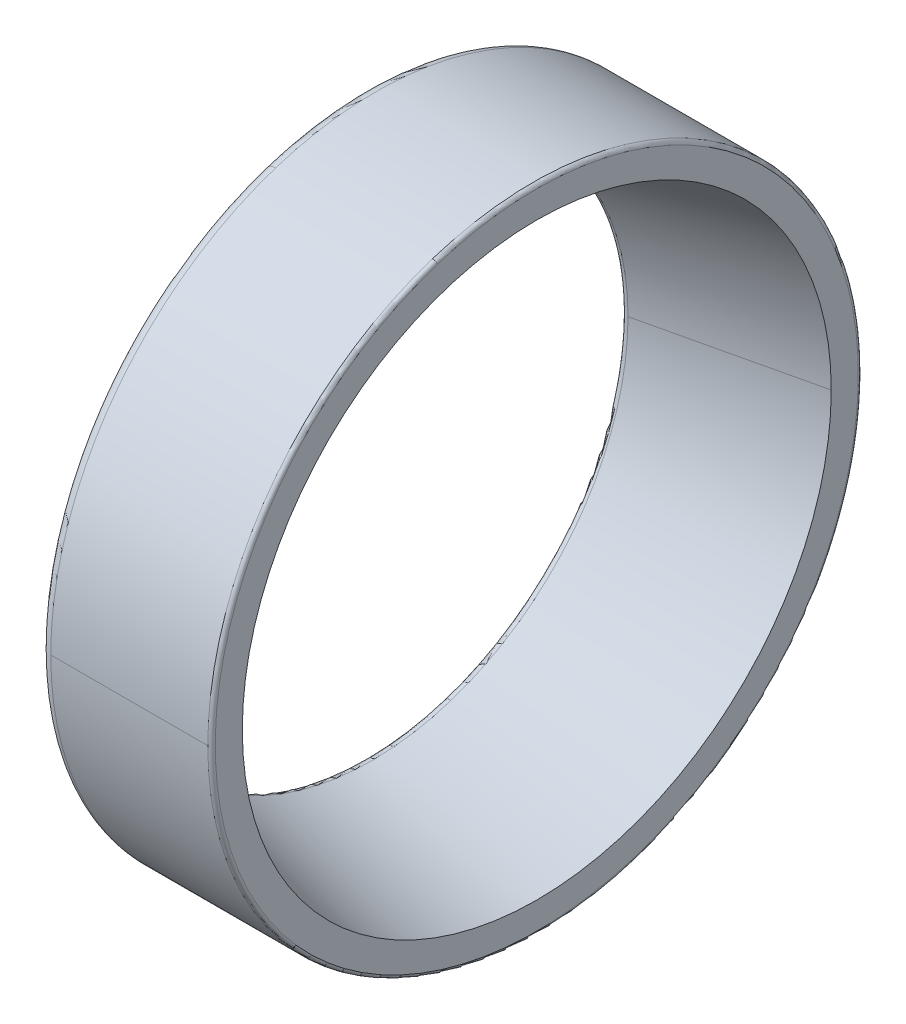
ISO-10303-21;
HEADER;
FILE_DESCRIPTION(('STEP AP214'),'2;1');
FILE_NAME('part.step','',(''),(''),'','','');
FILE_SCHEMA(('AUTOMOTIVE_DESIGN { 1 0 10303 214 1 1 1 1 }'));
ENDSEC;
DATA;
#1=APPLICATION_CONTEXT('core data for automotive mechanical design processes');
#2=APPLICATION_PROTOCOL_DEFINITION('international standard','automotive_design',2000,#1);
#3=PRODUCT_CONTEXT('',#1,'mechanical');
#4=PRODUCT('Part','Part','',(#3));
#5=PRODUCT_RELATED_PRODUCT_CATEGORY('part','',(#4));
#6=PRODUCT_DEFINITION_FORMATION('','',#4);
#7=PRODUCT_DEFINITION_CONTEXT('part definition',#1,'design');
#8=PRODUCT_DEFINITION('design','',#6,#7);
#9=PRODUCT_DEFINITION_SHAPE('','',#8);
#10=(LENGTH_UNIT() NAMED_UNIT(*) SI_UNIT(.MILLI.,.METRE.));
#11=(NAMED_UNIT(*) PLANE_ANGLE_UNIT() SI_UNIT($,.RADIAN.));
#12=(NAMED_UNIT(*) SI_UNIT($,.STERADIAN.) SOLID_ANGLE_UNIT());
#13=UNCERTAINTY_MEASURE_WITH_UNIT(LENGTH_MEASURE(1.E-05),#10,'distance_accuracy_value','');
#14=(GEOMETRIC_REPRESENTATION_CONTEXT(3) GLOBAL_UNCERTAINTY_ASSIGNED_CONTEXT((#13)) GLOBAL_UNIT_ASSIGNED_CONTEXT((#10,
#11,#12)) REPRESENTATION_CONTEXT('',''));
#15=CARTESIAN_POINT('',(0.,0.,0.));
#16=DIRECTION('',(0.,0.,1.));
#17=DIRECTION('',(1.,0.,0.));
#18=AXIS2_PLACEMENT_3D('',#15,#16,#17);
#19=CARTESIAN_POINT('',(0.,16.9,0.));
#20=DIRECTION('',(-1.,0.,0.));
#21=DIRECTION('',(0.,0.,1.));
#22=AXIS2_PLACEMENT_3D('',#19,#20,#21);
#23=PLANE('',#22);
#24=CARTESIAN_POINT('',(0.,0.,0.));
#25=DIRECTION('',(1.,0.,0.));
#26=DIRECTION('',(0.,0.,-1.));
#27=AXIS2_PLACEMENT_3D('',#24,#25,#26);
#28=CIRCLE('',#27,14.085804836206);
#29=CARTESIAN_POINT('',(0.,13.3963964767347,4.35275307383623));
#30=VERTEX_POINT('',#29);
#31=CARTESIAN_POINT('',(0.,-13.3963964767347,-4.35275307383623));
#32=VERTEX_POINT('',#31);
#33=EDGE_CURVE('E11',#30,#32,#28,.T.);
#34=ORIENTED_EDGE('',*,*,#33,.T.);
#35=CARTESIAN_POINT('',(0.,-13.3963964767355,-4.35275307383648));
#36=CARTESIAN_POINT('',(0.,-12.7126398523232,-6.45703442228354));
#37=CARTESIAN_POINT('',(0.,-11.6158787276221,-8.42718808582188));
#38=CARTESIAN_POINT('',(0.,-10.1405103292947,-10.1545294403803));
#39=CARTESIAN_POINT('',(0.,-6.59201516948742,-12.9375532881365));
#40=CARTESIAN_POINT('',(0.,-2.25474563902204,-14.1725400133612));
#41=CARTESIAN_POINT('',(0.,0.00991354990894505,-14.3507764187406));
#42=CARTESIAN_POINT('',(0.,4.48697211895278,-13.8094802222654));
#43=CARTESIAN_POINT('',(0.,8.4271545075314,-11.6158490436707));
#44=CARTESIAN_POINT('',(0.,10.1545375473403,-10.1405194899802));
#45=CARTESIAN_POINT('',(0.,12.9375553228074,-6.59201117622091));
#46=CARTESIAN_POINT('',(0.,14.1725278370594,-2.2547444648695));
#47=CARTESIAN_POINT('',(0.,14.3508201703857,0.00990383229015812));
#48=CARTESIAN_POINT('',(0.,14.0800912908607,2.24845164200969));
#49=CARTESIAN_POINT('',(0.,13.3963964767355,4.35275307383647));
#50=B_SPLINE_CURVE_WITH_KNOTS('',5,(#35,#36,#37,#38,#39,#40,#41,#42,#43,#44,#45,#46,#47,#48,
#49),.UNSPECIFIED.,.F.,.F.,(6,3,3,3,6),(0.,0.785398163397448,1.5707963267949,2.35619449019234,
3.14159265358979),.UNSPECIFIED.);
#51=EDGE_CURVE('E26',#32,#30,#50,.T.);
#52=ORIENTED_EDGE('',*,*,#51,.T.);
#53=EDGE_LOOP('',(#34,#52));
#54=FACE_BOUND('',#53,.T.);
#55=CARTESIAN_POINT('',(0.,16.0728551253881,5.22238720493665));
#56=CARTESIAN_POINT('',(0.,15.987409506985,5.48538076014823));
#57=CARTESIAN_POINT('',(0.,15.8954983020356,5.74627299413518));
#58=CARTESIAN_POINT('',(0.,15.6989902437607,6.26323546914296));
#59=CARTESIAN_POINT('',(0.,15.5943933904351,6.51930571016379));
#60=CARTESIAN_POINT('',(0.,15.3727595601241,7.02600484872245));
#61=CARTESIAN_POINT('',(0.,15.2557225831386,7.27663374626028));
#62=CARTESIAN_POINT('',(0.,15.0094921883233,7.77184706866862));
#63=CARTESIAN_POINT('',(0.,14.8802987704936,8.01643149353914));
#64=CARTESIAN_POINT('',(0.,14.6100662685669,8.49896646905802));
#65=CARTESIAN_POINT('',(0.,14.4690271844699,8.73691701970638));
#66=CARTESIAN_POINT('',(0.,14.1754432497592,9.20561105028911));
#67=CARTESIAN_POINT('',(0.,14.0228983991455,9.43635453022346));
#68=CARTESIAN_POINT('',(0.,13.7066703920169,9.8900785254699));
#69=CARTESIAN_POINT('',(0.,13.542987235502,10.113059040782));
#70=CARTESIAN_POINT('',(0.,13.2048769525523,10.5507199305825));
#71=CARTESIAN_POINT('',(0.,13.0304498261175,10.7654003050708));
#72=CARTESIAN_POINT('',(0.,12.6712718111635,11.1859437284894));
#73=CARTESIAN_POINT('',(0.,12.4865209226442,11.3918067774196));
#74=CARTESIAN_POINT('',(0.,12.1071404652344,11.7942196078489));
#75=CARTESIAN_POINT('',(0.,11.9125108963438,11.9907693893481));
#76=CARTESIAN_POINT('',(0.,11.5138419576987,12.3740821792106));
#77=CARTESIAN_POINT('',(0.,11.3098025879441,12.5608451875741));
#78=CARTESIAN_POINT('',(0.,10.8928055963306,12.9241345027371));
#79=CARTESIAN_POINT('',(0.,10.6798479744716,13.1006608095368));
#80=CARTESIAN_POINT('',(0.,10.2455275122007,13.4430514542325));
#81=CARTESIAN_POINT('',(0.,10.0241646717889,13.6089157921286));
#82=CARTESIAN_POINT('',(0.,9.57356705488723,13.9295829173006));
#83=CARTESIAN_POINT('',(0.,9.34433227839746,14.0843857045765));
#84=CARTESIAN_POINT('',(0.,8.87854303599429,14.382556795034));
#85=CARTESIAN_POINT('',(0.,8.64198857008088,14.5259250982157));
#86=CARTESIAN_POINT('',(0.,8.16212982925878,14.8008818336849));
#87=CARTESIAN_POINT('',(0.,7.91882555435008,14.9324702659725));
#88=CARTESIAN_POINT('',(0.,7.42605333684654,15.1835502515944));
#89=CARTESIAN_POINT('',(0.,7.17658539425168,15.3030418049287));
#90=CARTESIAN_POINT('',(0.,6.67208683150036,15.5296401670258));
#91=CARTESIAN_POINT('',(0.,6.41705621134388,15.6367469757886));
#92=CARTESIAN_POINT('',(0.,5.90204668457131,15.838317819059));
#93=CARTESIAN_POINT('',(0.,5.64206777795521,15.9327818535666));
#94=CARTESIAN_POINT('',(0.,5.1177879902209,16.1088395761933));
#95=CARTESIAN_POINT('',(0.,4.85348710910268,16.1904332643124));
#96=CARTESIAN_POINT('',(0.,4.32120009633676,16.3405537278209));
#97=CARTESIAN_POINT('',(0.,4.05321396468906,16.4090805032101));
#98=CARTESIAN_POINT('',(0.,3.51420205292812,16.5329020542546));
#99=CARTESIAN_POINT('',(0.,3.24317627281489,16.5881968299099));
#100=CARTESIAN_POINT('',(0.,2.69873798896623,16.6854211715285));
#101=CARTESIAN_POINT('',(0.,2.42532548523081,16.7273507374919));
#102=CARTESIAN_POINT('',(0.,1.87677242880739,16.7977436477299));
#103=CARTESIAN_POINT('',(0.,1.60163187611939,16.8262069920044));
#104=CARTESIAN_POINT('',(0.,1.05028555948171,16.8695988881753));
#105=CARTESIAN_POINT('',(0.,0.774079795532018,16.8845274400716));
#106=CARTESIAN_POINT('',(0.,0.221268460249076,16.9008137872967));
#107=CARTESIAN_POINT('',(0.,-0.0553371110841769,16.9021715826256));
#108=CARTESIAN_POINT('',(0.,-0.608281694085119,16.8913131456681));
#109=CARTESIAN_POINT('',(0.,-0.884620705752808,16.8790969133818));
#110=CARTESIAN_POINT('',(0.,-1.43636644453908,16.8411198511674));
#111=CARTESIAN_POINT('',(0.,-1.71177317165766,16.8153590212393));
#112=CARTESIAN_POINT('',(0.,-2.26099086241731,16.7503548238372));
#113=CARTESIAN_POINT('',(0.,-2.53480182605837,16.7111114563632));
#114=CARTESIAN_POINT('',(0.,-3.08016835526856,16.6192367245786));
#115=CARTESIAN_POINT('',(0.,-3.35172392083769,16.5666053602681));
#116=CARTESIAN_POINT('',(0.,-3.89192545276109,16.4480814283773));
#117=CARTESIAN_POINT('',(0.,-4.16057141911536,16.382188860797));
#118=CARTESIAN_POINT('',(0.,-4.6943065609455,16.2373012633333));
#119=CARTESIAN_POINT('',(0.,-4.95939573642137,16.1583062334499));
#120=CARTESIAN_POINT('',(0.,-5.48537867345191,15.9874040173263));
#121=CARTESIAN_POINT('',(0.,-5.74627243500658,15.895496831086));
#122=CARTESIAN_POINT('',(0.,-6.26323602827154,15.6989917147103));
#123=CARTESIAN_POINT('',(0.,-6.51930585998183,15.5943937845749));
#124=CARTESIAN_POINT('',(0.,-7.02600469890438,15.3727591659843));
#125=CARTESIAN_POINT('',(0.,-7.27663370611664,15.2557224775291));
#126=CARTESIAN_POINT('',(0.,-7.77184710881223,15.0094922939328));
#127=CARTESIAN_POINT('',(0.,-8.01643150429557,14.8802987987916));
#128=CARTESIAN_POINT('',(0.,-8.49896645830155,14.6100662402689));
#129=CARTESIAN_POINT('',(0.,-8.73691701682419,14.4690271768875));
#130=CARTESIAN_POINT('',(0.,-9.20561105317127,14.1754432573416));
#131=CARTESIAN_POINT('',(0.,-9.43635453099572,14.0228984011772));
#132=CARTESIAN_POINT('',(0.,-9.89007852469761,13.7066703899852));
#133=CARTESIAN_POINT('',(0.,-10.113059040575,13.5429872349576));
#134=CARTESIAN_POINT('',(0.,-10.5507199307894,13.2048769530967));
#135=CARTESIAN_POINT('',(0.,-10.7654003051263,13.0304498262634));
#136=CARTESIAN_POINT('',(0.,-11.185943728434,12.6712718110176));
#137=CARTESIAN_POINT('',(0.,-11.3918067774048,12.4865209226051));
#138=CARTESIAN_POINT('',(0.,-11.7942196078638,12.1071404652735));
#139=CARTESIAN_POINT('',(0.,-11.990769389352,11.9125108963543));
#140=CARTESIAN_POINT('',(0.,-12.3740821792066,11.5138419576882));
#141=CARTESIAN_POINT('',(0.,-12.560845187573,11.3098025879413));
#142=CARTESIAN_POINT('',(0.,-12.9241345027382,10.8928055963334));
#143=CARTESIAN_POINT('',(0.,-13.100660809537,10.6798479744724));
#144=CARTESIAN_POINT('',(0.,-13.4430514542322,10.2455275122));
#145=CARTESIAN_POINT('',(0.,-13.6089157921285,10.0241646717887));
#146=CARTESIAN_POINT('',(0.,-13.9295829173007,9.57356705488745));
#147=CARTESIAN_POINT('',(0.,-14.0843857045765,9.34433227839753));
#148=CARTESIAN_POINT('',(0.,-14.382556795034,8.87854303599425));
#149=CARTESIAN_POINT('',(0.,-14.5259250982157,8.64198857008088));
#150=CARTESIAN_POINT('',(0.,-14.8008818336849,8.16212982925881));
#151=CARTESIAN_POINT('',(0.,-14.9324702659725,7.91882555435011));
#152=CARTESIAN_POINT('',(0.,-15.1835502515944,7.42605333684655));
#153=CARTESIAN_POINT('',(0.,-15.3030418049286,7.1765853942517));
#154=CARTESIAN_POINT('',(0.,-15.5296401670258,6.67208683150036));
#155=CARTESIAN_POINT('',(0.,-15.6367469757886,6.41705621134388));
#156=CARTESIAN_POINT('',(0.,-15.8383178190589,5.90204668457134));
#157=CARTESIAN_POINT('',(0.,-15.9327818535664,5.64206777795529));
#158=CARTESIAN_POINT('',(0.,-16.1088395761935,5.11778799022086));
#159=CARTESIAN_POINT('',(0.,-16.1904332643132,4.85348710910249));
#160=CARTESIAN_POINT('',(0.,-16.3405537278201,4.32120009633699));
#161=CARTESIAN_POINT('',(0.,-16.4090805032072,4.05321396468987));
#162=CARTESIAN_POINT('',(0.,-16.5329020542575,3.51420205292736));
#163=CARTESIAN_POINT('',(0.,-16.5881968299207,3.24317627281197));
#164=CARTESIAN_POINT('',(0.,-16.6854211715177,2.69873798896919));
#165=CARTESIAN_POINT('',(0.,-16.7273507374515,2.42532548524178));
#166=CARTESIAN_POINT('',(0.,-16.7977436477702,1.87677242879645));
#167=CARTESIAN_POINT('',(0.,-16.826206992155,1.60163187607852));
#168=CARTESIAN_POINT('',(0.,-16.8695988880247,1.0502855595226));
#169=CARTESIAN_POINT('',(0.,-16.8845274395095,0.774079795684606));
#170=CARTESIAN_POINT('',(0.,-16.9008137878588,0.221268460096517));
#171=CARTESIAN_POINT('',(0.,-16.9021715847233,-0.0553371116535784));
#172=CARTESIAN_POINT('',(0.,-16.8913131435705,-0.608281693515684));
#173=CARTESIAN_POINT('',(0.,-16.8790969055534,-0.884620703627695));
#174=CARTESIAN_POINT('',(0.,-16.8411198589958,-1.43636644666416));
#175=CARTESIAN_POINT('',(0.,-16.8153590504553,-1.71177317958862));
#176=CARTESIAN_POINT('',(0.,-16.7503547946212,-2.26099085448633));
#177=CARTESIAN_POINT('',(0.,-16.7111113473275,-2.53480179645957));
#178=CARTESIAN_POINT('',(0.,-16.6192368336143,-3.08016838486734));
#179=CARTESIAN_POINT('',(0.,-16.5666057671948,-3.35172403130186));
#180=CARTESIAN_POINT('',(0.,-16.4480810214507,-3.89192534229689));
#181=CARTESIAN_POINT('',(0.,-16.3821873421262,-4.16057100685739));
#182=CARTESIAN_POINT('',(0.,-16.2373027820041,-4.69430697320345));
#183=CARTESIAN_POINT('',(0.,-16.1583119012064,-4.959397274989));
#184=CARTESIAN_POINT('',(0.,-16.0728551253881,-5.22238720493662));
#185=B_SPLINE_CURVE_WITH_KNOTS('',3,(#55,#56,#57,#58,#59,#60,#61,#62,#63,#64,#65,#66,#67,#68,
#69,#70,#71,#72,#73,#74,#75,#76,#77,#78,#79,#80,#81,#82,#83,#84,#85,#86,#87,#88,#89,#90,#91,#92,
#93,#94,#95,#96,#97,#98,#99,#100,#101,#102,#103,#104,#105,#106,#107,#108,#109,#110,#111,#112,
#113,#114,#115,#116,#117,#118,#119,#120,#121,#122,#123,#124,#125,#126,#127,#128,#129,#130,#131,
#132,#133,#134,#135,#136,#137,#138,#139,#140,#141,#142,#143,#144,#145,#146,#147,#148,#149,#150,
#151,#152,#153,#154,#155,#156,#157,#158,#159,#160,#161,#162,#163,#164,#165,#166,#167,#168,#169,
#170,#171,#172,#173,#174,#175,#176,#177,#178,#179,#180,#181,#182,#183,#184),.UNSPECIFIED.,.F.,
.F.,(4,2,2,2,2,2,2,2,2,2,2,2,2,2,2,2,2,2,2,2,2,2,2,2,2,2,2,2,2,2,2,2,2,2,2,2,2,2,2,2,2,2,2,2,2,
2,2,2,2,2,2,2,2,2,2,2,2,2,2,2,2,2,2,2,4),(0.,0.829493524074432,1.65898704814887,2.4884805722233,
3.31797409629774,4.14746762037217,4.97696114444661,5.80645466852104,6.63594819259548,
7.46544171666991,8.29493524074435,9.12442876481879,9.95392228889322,10.7834158129677,
11.6129093370421,12.4424028611165,13.271896385191,14.1013899092654,14.9308834333398,
15.7603769574143,16.5898704814887,17.4193640055631,18.2488575296376,19.078351053712,
19.9078445777864,20.7373381018609,21.5668316259353,22.3963251500097,23.2258186740842,
24.0553121981586,24.8848057222331,25.7142992463075,26.5437927703819,27.3732862944564,
28.2027798185308,29.0322733426052,29.8617668666797,30.6912603907541,31.5207539148285,
32.350247438903,33.1797409629774,34.0092344870518,34.8387280111263,35.6682215352007,
36.4977150592751,37.3272085833496,38.156702107424,38.9861956314984,39.8156891555729,
40.6451826796473,41.4746762037217,42.3041697277962,43.1336632518706,43.963156775945,
44.7926503000195,45.6221438240939,46.4516373481684,47.2811308722428,48.1106243963172,
48.9401179203916,49.7696114444661,50.5991049685405,51.4285984926149,52.2580920166894,
53.0875855407638),.UNSPECIFIED.);
#186=CARTESIAN_POINT('',(0.,16.0728551253881,5.22238720493661));
#187=VERTEX_POINT('',#186);
#188=CARTESIAN_POINT('',(0.,-16.0728551253881,-5.22238720493661));
#189=VERTEX_POINT('',#188);
#190=EDGE_CURVE('E200',#187,#189,#185,.T.);
#191=ORIENTED_EDGE('',*,*,#190,.F.);
#192=CARTESIAN_POINT('',(0.,-16.0728551253881,-5.22238720493665));
#193=CARTESIAN_POINT('',(0.,-15.987409506985,-5.48538076014823));
#194=CARTESIAN_POINT('',(0.,-15.8954983020356,-5.74627299413518));
#195=CARTESIAN_POINT('',(0.,-15.6989902437607,-6.26323546914296));
#196=CARTESIAN_POINT('',(0.,-15.5943933904351,-6.51930571016379));
#197=CARTESIAN_POINT('',(0.,-15.3727595601241,-7.02600484872245));
#198=CARTESIAN_POINT('',(0.,-15.2557225831386,-7.27663374626028));
#199=CARTESIAN_POINT('',(0.,-15.0094921883234,-7.77184706866862));
#200=CARTESIAN_POINT('',(0.,-14.8802987704936,-8.01643149353913));
#201=CARTESIAN_POINT('',(0.,-14.6100662685669,-8.49896646905801));
#202=CARTESIAN_POINT('',(0.,-14.4690271844699,-8.73691701970638));
#203=CARTESIAN_POINT('',(0.,-14.1754432497592,-9.2056110502891));
#204=CARTESIAN_POINT('',(0.,-14.0228983991455,-9.43635453022345));
#205=CARTESIAN_POINT('',(0.,-13.7066703920169,-9.8900785254699));
#206=CARTESIAN_POINT('',(0.,-13.542987235502,-10.113059040782));
#207=CARTESIAN_POINT('',(0.,-13.2048769525523,-10.5507199305825));
#208=CARTESIAN_POINT('',(0.,-13.0304498261175,-10.7654003050708));
#209=CARTESIAN_POINT('',(0.,-12.6712718111635,-11.1859437284894));
#210=CARTESIAN_POINT('',(0.,-12.4865209226442,-11.3918067774196));
#211=CARTESIAN_POINT('',(0.,-12.1071404652344,-11.7942196078489));
#212=CARTESIAN_POINT('',(0.,-11.9125108963438,-11.9907693893481));
#213=CARTESIAN_POINT('',(0.,-11.5138419576987,-12.3740821792106));
#214=CARTESIAN_POINT('',(0.,-11.3098025879441,-12.5608451875741));
#215=CARTESIAN_POINT('',(0.,-10.8928055963306,-12.9241345027371));
#216=CARTESIAN_POINT('',(0.,-10.6798479744716,-13.1006608095367));
#217=CARTESIAN_POINT('',(0.,-10.2455275122007,-13.4430514542325));
#218=CARTESIAN_POINT('',(0.,-10.0241646717889,-13.6089157921286));
#219=CARTESIAN_POINT('',(0.,-9.57356705488725,-13.9295829173006));
#220=CARTESIAN_POINT('',(0.,-9.34433227839748,-14.0843857045765));
#221=CARTESIAN_POINT('',(0.,-8.8785430359943,-14.382556795034));
#222=CARTESIAN_POINT('',(0.,-8.64198857008089,-14.5259250982157));
#223=CARTESIAN_POINT('',(0.,-8.16212982925879,-14.8008818336849));
#224=CARTESIAN_POINT('',(0.,-7.9188255543501,-14.9324702659725));
#225=CARTESIAN_POINT('',(0.,-7.42605333684655,-15.1835502515944));
#226=CARTESIAN_POINT('',(0.,-7.1765853942517,-15.3030418049287));
#227=CARTESIAN_POINT('',(0.,-6.67208683150037,-15.5296401670258));
#228=CARTESIAN_POINT('',(0.,-6.4170562113439,-15.6367469757886));
#229=CARTESIAN_POINT('',(0.,-5.90204668457133,-15.838317819059));
#230=CARTESIAN_POINT('',(0.,-5.64206777795523,-15.9327818535666));
#231=CARTESIAN_POINT('',(0.,-5.11778799022092,-16.1088395761933));
#232=CARTESIAN_POINT('',(0.,-4.8534871091027,-16.1904332643124));
#233=CARTESIAN_POINT('',(0.,-4.32120009633678,-16.3405537278208));
#234=CARTESIAN_POINT('',(0.,-4.05321396468908,-16.4090805032101));
#235=CARTESIAN_POINT('',(0.,-3.51420205292814,-16.5329020542546));
#236=CARTESIAN_POINT('',(0.,-3.24317627281491,-16.5881968299098));
#237=CARTESIAN_POINT('',(0.,-2.69873798896626,-16.6854211715285));
#238=CARTESIAN_POINT('',(0.,-2.42532548523084,-16.7273507374919));
#239=CARTESIAN_POINT('',(0.,-1.87677242880742,-16.7977436477299));
#240=CARTESIAN_POINT('',(0.,-1.60163187611942,-16.8262069920044));
#241=CARTESIAN_POINT('',(0.,-1.05028555948173,-16.8695988881753));
#242=CARTESIAN_POINT('',(0.,-0.774079795532037,-16.8845274400716));
#243=CARTESIAN_POINT('',(0.,-0.221268460249095,-16.9008137872967));
#244=CARTESIAN_POINT('',(0.,0.055337111084155,-16.9021715826256));
#245=CARTESIAN_POINT('',(0.,0.608281694085094,-16.8913131456681));
#246=CARTESIAN_POINT('',(0.,0.884620705752784,-16.8790969133818));
#247=CARTESIAN_POINT('',(0.,1.43636644453905,-16.8411198511674));
#248=CARTESIAN_POINT('',(0.,1.71177317165763,-16.8153590212393));
#249=CARTESIAN_POINT('',(0.,2.26099086241728,-16.7503548238372));
#250=CARTESIAN_POINT('',(0.,2.53480182605834,-16.7111114563632));
#251=CARTESIAN_POINT('',(0.,3.08016835526853,-16.6192367245786));
#252=CARTESIAN_POINT('',(0.,3.35172392083766,-16.5666053602681));
#253=CARTESIAN_POINT('',(0.,3.89192545276106,-16.4480814283773));
#254=CARTESIAN_POINT('',(0.,4.16057141911533,-16.382188860797));
#255=CARTESIAN_POINT('',(0.,4.69430656094547,-16.2373012633333));
#256=CARTESIAN_POINT('',(0.,4.95939573642134,-16.1583062334499));
#257=CARTESIAN_POINT('',(0.,5.48537867345187,-15.9874040173263));
#258=CARTESIAN_POINT('',(0.,5.74627243500654,-15.895496831086));
#259=CARTESIAN_POINT('',(0.,6.26323602827151,-15.6989917147103));
#260=CARTESIAN_POINT('',(0.,6.5193058599818,-15.5943937845749));
#261=CARTESIAN_POINT('',(0.,7.02600469890435,-15.3727591659843));
#262=CARTESIAN_POINT('',(0.,7.27663370611661,-15.2557224775292));
#263=CARTESIAN_POINT('',(0.,7.77184710881221,-15.0094922939328));
#264=CARTESIAN_POINT('',(0.,8.01643150429554,-14.8802987987916));
#265=CARTESIAN_POINT('',(0.,8.49896645830152,-14.610066240269));
#266=CARTESIAN_POINT('',(0.,8.73691701682415,-14.4690271768875));
#267=CARTESIAN_POINT('',(0.,9.20561105317124,-14.1754432573416));
#268=CARTESIAN_POINT('',(0.,9.43635453099569,-14.0228984011772));
#269=CARTESIAN_POINT('',(0.,9.89007852469758,-13.7066703899852));
#270=CARTESIAN_POINT('',(0.,10.113059040575,-13.5429872349576));
#271=CARTESIAN_POINT('',(0.,10.5507199307894,-13.2048769530967));
#272=CARTESIAN_POINT('',(0.,10.7654003051262,-13.0304498262634));
#273=CARTESIAN_POINT('',(0.,11.1859437284339,-12.6712718110176));
#274=CARTESIAN_POINT('',(0.,11.3918067774047,-12.4865209226052));
#275=CARTESIAN_POINT('',(0.,11.7942196078638,-12.1071404652735));
#276=CARTESIAN_POINT('',(0.,11.990769389352,-11.9125108963543));
#277=CARTESIAN_POINT('',(0.,12.3740821792066,-11.5138419576882));
#278=CARTESIAN_POINT('',(0.,12.560845187573,-11.3098025879414));
#279=CARTESIAN_POINT('',(0.,12.9241345027382,-10.8928055963335));
#280=CARTESIAN_POINT('',(0.,13.100660809537,-10.6798479744724));
#281=CARTESIAN_POINT('',(0.,13.4430514542322,-10.2455275122));
#282=CARTESIAN_POINT('',(0.,13.6089157921285,-10.0241646717887));
#283=CARTESIAN_POINT('',(0.,13.9295829173006,-9.57356705488749));
#284=CARTESIAN_POINT('',(0.,14.0843857045765,-9.34433227839757));
#285=CARTESIAN_POINT('',(0.,14.382556795034,-8.87854303599429));
#286=CARTESIAN_POINT('',(0.,14.5259250982157,-8.64198857008092));
#287=CARTESIAN_POINT('',(0.,14.8008818336849,-8.16212982925885));
#288=CARTESIAN_POINT('',(0.,14.9324702659725,-7.91882555435015));
#289=CARTESIAN_POINT('',(0.,15.1835502515943,-7.42605333684659));
#290=CARTESIAN_POINT('',(0.,15.3030418049286,-7.17658539425174));
#291=CARTESIAN_POINT('',(0.,15.5296401670258,-6.67208683150041));
#292=CARTESIAN_POINT('',(0.,15.6367469757886,-6.41705621134392));
#293=CARTESIAN_POINT('',(0.,15.8383178190589,-5.90204668457138));
#294=CARTESIAN_POINT('',(0.,15.9327818535663,-5.64206777795533));
#295=CARTESIAN_POINT('',(0.,16.1088395761935,-5.11778799022091));
#296=CARTESIAN_POINT('',(0.,16.1904332643132,-4.85348710910253));
#297=CARTESIAN_POINT('',(0.,16.3405537278201,-4.32120009633704));
#298=CARTESIAN_POINT('',(0.,16.4090805032072,-4.05321396468991));
#299=CARTESIAN_POINT('',(0.,16.5329020542575,-3.5142020529274));
#300=CARTESIAN_POINT('',(0.,16.5881968299207,-3.24317627281202));
#301=CARTESIAN_POINT('',(0.,16.6854211715177,-2.69873798896924));
#302=CARTESIAN_POINT('',(0.,16.7273507374515,-2.42532548524184));
#303=CARTESIAN_POINT('',(0.,16.7977436477702,-1.87677242879651));
#304=CARTESIAN_POINT('',(0.,16.826206992155,-1.60163187607858));
#305=CARTESIAN_POINT('',(0.,16.8695988880247,-1.05028555952266));
#306=CARTESIAN_POINT('',(0.,16.8845274395095,-0.774079795684668));
#307=CARTESIAN_POINT('',(0.,16.9008137878588,-0.221268460096578));
#308=CARTESIAN_POINT('',(0.,16.9021715847233,0.0553371116535163));
#309=CARTESIAN_POINT('',(0.,16.8913131435705,0.608281693515621));
#310=CARTESIAN_POINT('',(0.,16.8790969055534,0.884620703627632));
#311=CARTESIAN_POINT('',(0.,16.8411198589958,1.4363664466641));
#312=CARTESIAN_POINT('',(0.,16.8153590504553,1.71177317958856));
#313=CARTESIAN_POINT('',(0.,16.7503547946212,2.26099085448627));
#314=CARTESIAN_POINT('',(0.,16.7111113473275,2.53480179645951));
#315=CARTESIAN_POINT('',(0.,16.6192368336143,3.08016838486728));
#316=CARTESIAN_POINT('',(0.,16.5666057671948,3.3517240313018));
#317=CARTESIAN_POINT('',(0.,16.4480810214507,3.89192534229683));
#318=CARTESIAN_POINT('',(0.,16.3821873421262,4.16057100685733));
#319=CARTESIAN_POINT('',(0.,16.2373027820041,4.69430697320339));
#320=CARTESIAN_POINT('',(0.,16.1583119012064,4.95939727498894));
#321=CARTESIAN_POINT('',(0.,16.0728551253881,5.22238720493656));
#322=B_SPLINE_CURVE_WITH_KNOTS('',3,(#192,#193,#194,#195,#196,#197,#198,#199,#200,#201,#202,
#203,#204,#205,#206,#207,#208,#209,#210,#211,#212,#213,#214,#215,#216,#217,#218,#219,#220,#221,
#222,#223,#224,#225,#226,#227,#228,#229,#230,#231,#232,#233,#234,#235,#236,#237,#238,#239,#240,
#241,#242,#243,#244,#245,#246,#247,#248,#249,#250,#251,#252,#253,#254,#255,#256,#257,#258,#259,
#260,#261,#262,#263,#264,#265,#266,#267,#268,#269,#270,#271,#272,#273,#274,#275,#276,#277,#278,
#279,#280,#281,#282,#283,#284,#285,#286,#287,#288,#289,#290,#291,#292,#293,#294,#295,#296,#297,
#298,#299,#300,#301,#302,#303,#304,#305,#306,#307,#308,#309,#310,#311,#312,#313,#314,#315,#316,
#317,#318,#319,#320,#321),.UNSPECIFIED.,.F.,.F.,(4,2,2,2,2,2,2,2,2,2,2,2,2,2,2,2,2,2,2,2,2,2,2,
2,2,2,2,2,2,2,2,2,2,2,2,2,2,2,2,2,2,2,2,2,2,2,2,2,2,2,2,2,2,2,2,2,2,2,2,2,2,2,2,2,4),(0.,
0.829493524074432,1.65898704814887,2.4884805722233,3.31797409629774,4.14746762037217,
4.9769611444466,5.80645466852103,6.63594819259547,7.46544171666991,8.29493524074434,
9.12442876481877,9.9539222888932,10.7834158129676,11.6129093370421,12.4424028611165,
13.2718963851909,14.1013899092654,14.9308834333398,15.7603769574142,16.5898704814887,
17.4193640055631,18.2488575296375,19.078351053712,19.9078445777864,20.7373381018609,
21.5668316259353,22.3963251500097,23.2258186740841,24.0553121981586,24.884805722233,
25.7142992463075,26.5437927703819,27.3732862944563,28.2027798185308,29.0322733426052,
29.8617668666796,30.6912603907541,31.5207539148285,32.3502474389029,33.1797409629774,
34.0092344870518,34.8387280111262,35.6682215352007,36.4977150592751,37.3272085833495,
38.156702107424,38.9861956314984,39.8156891555728,40.6451826796473,41.4746762037217,
42.3041697277961,43.1336632518706,43.963156775945,44.7926503000194,45.6221438240939,
46.4516373481683,47.2811308722427,48.1106243963171,48.9401179203916,49.769611444466,
50.5991049685405,51.4285984926149,52.2580920166893,53.0875855407638),.UNSPECIFIED.);
#323=EDGE_CURVE('E301',#189,#187,#322,.T.);
#324=ORIENTED_EDGE('',*,*,#323,.F.);
#325=EDGE_LOOP('',(#191,#324));
#326=FACE_BOUND('',#325,.T.);
#327=ADVANCED_FACE('F17',(#54,#326),#23,.T.);
#328=CARTESIAN_POINT('',(0.599999999999879,0.,0.));
#329=DIRECTION('',(1.,0.,0.));
#330=DIRECTION('',(0.,-0.309016994374947,0.951056516295154));
#331=AXIS2_PLACEMENT_3D('',#328,#329,#330);
#332=TOROIDAL_SURFACE('',#331,16.9,0.599999999999878);
#333=CARTESIAN_POINT('',(0.599999999999879,-16.0728551253881,-5.22238720493661));
#334=DIRECTION('',(0.,0.309016994374947,-0.951056516295154));
#335=DIRECTION('',(2.00950367457194E-13,-0.951056516295154,-0.309016994374947));
#336=AXIS2_PLACEMENT_3D('',#333,#334,#335);
#337=CIRCLE('',#336,0.599999999999878);
#338=CARTESIAN_POINT('',(0.6,-16.6434890351651,-5.40779740156154));
#339=VERTEX_POINT('',#338);
#340=EDGE_CURVE('E264',#339,#189,#337,.T.);
#341=ORIENTED_EDGE('',*,*,#340,.T.);
#342=ORIENTED_EDGE('',*,*,#323,.T.);
#343=CARTESIAN_POINT('',(0.599999999999879,16.0728551253881,5.22238720493661));
#344=DIRECTION('',(0.,-0.309016994374947,0.951056516295154));
#345=DIRECTION('',(2.02800739164903E-13,0.951056516295154,0.309016994374947));
#346=AXIS2_PLACEMENT_3D('',#343,#344,#345);
#347=CIRCLE('',#346,0.599999999999878);
#348=CARTESIAN_POINT('',(0.600000000000001,16.6434890351651,5.40779740156154));
#349=VERTEX_POINT('',#348);
#350=EDGE_CURVE('E260',#349,#187,#347,.T.);
#351=ORIENTED_EDGE('',*,*,#350,.F.);
#352=CARTESIAN_POINT('',(0.6,0.,0.));
#353=DIRECTION('',(1.,0.,0.));
#354=DIRECTION('',(0.,0.,-1.));
#355=AXIS2_PLACEMENT_3D('',#352,#353,#354);
#356=CIRCLE('',#355,17.5);
#357=CARTESIAN_POINT('',(0.6,0.,-17.5));
#358=VERTEX_POINT('',#357);
#359=EDGE_CURVE('E255',#358,#349,#356,.T.);
#360=ORIENTED_EDGE('',*,*,#359,.F.);
#361=CARTESIAN_POINT('',(0.6,0.,0.));
#362=DIRECTION('',(1.,0.,0.));
#363=DIRECTION('',(0.,0.,-1.));
#364=AXIS2_PLACEMENT_3D('',#361,#362,#363);
#365=CIRCLE('',#364,17.5);
#366=EDGE_CURVE('E250',#339,#358,#365,.T.);
#367=ORIENTED_EDGE('',*,*,#366,.F.);
#368=EDGE_LOOP('',(#341,#342,#351,#360,#367));
#369=FACE_BOUND('',#368,.T.);
#370=ADVANCED_FACE('F272',(#369),#332,.T.);
#371=CARTESIAN_POINT('',(9.25,0.,0.));
#372=DIRECTION('',(1.,0.,0.));
#373=DIRECTION('',(0.,1.,0.));
#374=AXIS2_PLACEMENT_3D('',#371,#372,#373);
#375=CYLINDRICAL_SURFACE('',#374,17.5);
#376=DIRECTION('',(1.,0.,0.));
#377=VECTOR('',#376,1.);
#378=CARTESIAN_POINT('',(0.6,0.,17.5));
#379=LINE('',#378,#377);
#380=CARTESIAN_POINT('',(0.6,0.,17.5));
#381=VERTEX_POINT('',#380);
#382=CARTESIAN_POINT('',(9.05,0.,17.5));
#383=VERTEX_POINT('',#382);
#384=EDGE_CURVE('E245',#381,#383,#379,.T.);
#385=ORIENTED_EDGE('',*,*,#384,.F.);
#386=CARTESIAN_POINT('',(0.6,0.,0.));
#387=DIRECTION('',(1.,0.,0.));
#388=DIRECTION('',(0.,0.,-1.));
#389=AXIS2_PLACEMENT_3D('',#386,#387,#388);
#390=CIRCLE('',#389,17.5);
#391=EDGE_CURVE('E240',#381,#339,#390,.T.);
#392=ORIENTED_EDGE('',*,*,#391,.T.);
#393=ORIENTED_EDGE('',*,*,#366,.T.);
#394=DIRECTION('',(1.,0.,0.));
#395=VECTOR('',#394,1.);
#396=CARTESIAN_POINT('',(0.6,0.,-17.5));
#397=LINE('',#396,#395);
#398=CARTESIAN_POINT('',(9.05,0.,-17.5));
#399=VERTEX_POINT('',#398);
#400=EDGE_CURVE('E236',#358,#399,#397,.T.);
#401=ORIENTED_EDGE('',*,*,#400,.T.);
#402=CARTESIAN_POINT('',(9.05,0.,0.));
#403=DIRECTION('',(1.,0.,0.));
#404=DIRECTION('',(0.,0.,-1.));
#405=AXIS2_PLACEMENT_3D('',#402,#403,#404);
#406=CIRCLE('',#405,17.5);
#407=CARTESIAN_POINT('',(9.05,-16.6434890351652,-5.40779740156158));
#408=VERTEX_POINT('',#407);
#409=EDGE_CURVE('E231',#408,#399,#406,.T.);
#410=ORIENTED_EDGE('',*,*,#409,.F.);
#411=CARTESIAN_POINT('',(9.05,0.,0.));
#412=DIRECTION('',(1.,0.,0.));
#413=DIRECTION('',(0.,0.,-1.));
#414=AXIS2_PLACEMENT_3D('',#411,#412,#413);
#415=CIRCLE('',#414,17.5);
#416=EDGE_CURVE('E226',#383,#408,#415,.T.);
#417=ORIENTED_EDGE('',*,*,#416,.F.);
#418=EDGE_LOOP('',(#385,#392,#393,#401,#410,#417));
#419=FACE_BOUND('',#418,.T.);
#420=ADVANCED_FACE('F281',(#419),#375,.T.);
#421=CARTESIAN_POINT('',(9.04999999999945,0.,0.));
#422=DIRECTION('',(1.,0.,0.));
#423=DIRECTION('',(0.,0.309016994374947,-0.951056516295154));
#424=AXIS2_PLACEMENT_3D('',#421,#422,#423);
#425=TOROIDAL_SURFACE('',#424,17.2999999999995,0.200000000000545);
#426=CARTESIAN_POINT('',(9.04999999999945,-16.4532777319056,-5.34599400268642));
#427=DIRECTION('',(0.,0.309016994374947,-0.951056516295154));
#428=DIRECTION('',(1.,0.,0.));
#429=AXIS2_PLACEMENT_3D('',#426,#427,#428);
#430=CIRCLE('',#429,0.200000000000545);
#431=CARTESIAN_POINT('',(9.24999999999999,-16.4532777319056,-5.34599400268642));
#432=VERTEX_POINT('',#431);
#433=EDGE_CURVE('E222',#432,#408,#430,.T.);
#434=ORIENTED_EDGE('',*,*,#433,.F.);
#435=CARTESIAN_POINT('',(9.25,0.,0.));
#436=DIRECTION('',(1.,0.,0.));
#437=DIRECTION('',(0.,0.,-1.));
#438=AXIS2_PLACEMENT_3D('',#435,#436,#437);
#439=CIRCLE('',#438,17.3);
#440=CARTESIAN_POINT('',(9.24999999999999,16.4532777319056,5.34599400268642));
#441=VERTEX_POINT('',#440);
#442=EDGE_CURVE('E218',#441,#432,#439,.T.);
#443=ORIENTED_EDGE('',*,*,#442,.F.);
#444=CARTESIAN_POINT('',(9.04999999999945,16.4532777319056,5.34599400268642));
#445=DIRECTION('',(0.,-0.309016994374947,0.951056516295154));
#446=DIRECTION('',(1.,0.,0.));
#447=AXIS2_PLACEMENT_3D('',#444,#445,#446);
#448=CIRCLE('',#447,0.200000000000545);
#449=CARTESIAN_POINT('',(9.05,16.6434890351652,5.40779740156158));
#450=VERTEX_POINT('',#449);
#451=EDGE_CURVE('E214',#441,#450,#448,.T.);
#452=ORIENTED_EDGE('',*,*,#451,.T.);
#453=CARTESIAN_POINT('',(9.05,0.,0.));
#454=DIRECTION('',(1.,0.,0.));
#455=DIRECTION('',(0.,0.,-1.));
#456=AXIS2_PLACEMENT_3D('',#453,#454,#455);
#457=CIRCLE('',#456,17.5);
#458=EDGE_CURVE('E209',#450,#383,#457,.T.);
#459=ORIENTED_EDGE('',*,*,#458,.T.);
#460=ORIENTED_EDGE('',*,*,#416,.T.);
#461=EDGE_LOOP('',(#434,#443,#452,#459,#460));
#462=FACE_BOUND('',#461,.T.);
#463=ADVANCED_FACE('F285',(#462),#425,.T.);
#464=CARTESIAN_POINT('',(9.25,0.,0.));
#465=DIRECTION('',(1.,0.,0.));
#466=DIRECTION('',(0.,-1.,0.));
#467=AXIS2_PLACEMENT_3D('',#464,#465,#466);
#468=CYLINDRICAL_SURFACE('',#467,17.5);
#469=ORIENTED_EDGE('',*,*,#384,.T.);
#470=ORIENTED_EDGE('',*,*,#458,.F.);
#471=CARTESIAN_POINT('',(9.05,0.,0.));
#472=DIRECTION('',(1.,0.,0.));
#473=DIRECTION('',(0.,0.,-1.));
#474=AXIS2_PLACEMENT_3D('',#471,#472,#473);
#475=CIRCLE('',#474,17.5);
#476=EDGE_CURVE('E204',#399,#450,#475,.T.);
#477=ORIENTED_EDGE('',*,*,#476,.F.);
#478=ORIENTED_EDGE('',*,*,#400,.F.);
#479=ORIENTED_EDGE('',*,*,#359,.T.);
#480=CARTESIAN_POINT('',(0.6,0.,0.));
#481=DIRECTION('',(1.,0.,0.));
#482=DIRECTION('',(0.,0.,-1.));
#483=AXIS2_PLACEMENT_3D('',#480,#481,#482);
#484=CIRCLE('',#483,17.5);
#485=EDGE_CURVE('E201',#349,#381,#484,.T.);
#486=ORIENTED_EDGE('',*,*,#485,.T.);
#487=EDGE_LOOP('',(#469,#470,#477,#478,#479,#486));
#488=FACE_BOUND('',#487,.T.);
#489=ADVANCED_FACE('F288',(#488),#468,.T.);
#490=CARTESIAN_POINT('',(0.599999999999879,0.,0.));
#491=DIRECTION('',(1.,0.,0.));
#492=DIRECTION('',(0.,0.309016994374947,-0.951056516295154));
#493=AXIS2_PLACEMENT_3D('',#490,#491,#492);
#494=TOROIDAL_SURFACE('',#493,16.9,0.599999999999878);
#495=ORIENTED_EDGE('',*,*,#340,.F.);
#496=ORIENTED_EDGE('',*,*,#391,.F.);
#497=ORIENTED_EDGE('',*,*,#485,.F.);
#498=ORIENTED_EDGE('',*,*,#350,.T.);
#499=ORIENTED_EDGE('',*,*,#190,.T.);
#500=EDGE_LOOP('',(#495,#496,#497,#498,#499));
#501=FACE_BOUND('',#500,.T.);
#502=ADVANCED_FACE('F170',(#501),#494,.T.);
#503=CARTESIAN_POINT('',(9.04999999999945,0.,0.));
#504=DIRECTION('',(1.,0.,0.));
#505=DIRECTION('',(0.,-0.309016994374947,0.951056516295154));
#506=AXIS2_PLACEMENT_3D('',#503,#504,#505);
#507=TOROIDAL_SURFACE('',#506,17.2999999999995,0.200000000000545);
#508=ORIENTED_EDGE('',*,*,#433,.T.);
#509=ORIENTED_EDGE('',*,*,#409,.T.);
#510=ORIENTED_EDGE('',*,*,#476,.T.);
#511=ORIENTED_EDGE('',*,*,#451,.F.);
#512=CARTESIAN_POINT('',(9.25,-16.4532777319062,-5.34599400268659));
#513=CARTESIAN_POINT('',(9.25,-15.6134968503814,-7.9304446429909));
#514=CARTESIAN_POINT('',(9.25,-14.2664692805718,-10.3501614270546));
#515=CARTESIAN_POINT('',(9.25,-12.4544412432773,-12.4716593308911));
#516=CARTESIAN_POINT('',(9.25,-8.09622621910819,-15.8897325703006));
#517=CARTESIAN_POINT('',(9.25,-2.76924890048297,-17.4065270023427));
#518=CARTESIAN_POINT('',(9.25,0.0121756914439018,-17.6254346081855));
#519=CARTESIAN_POINT('',(9.25,5.51084006633099,-16.9606217481527));
#520=CARTESIAN_POINT('',(9.25,10.3501201866404,-14.2664328231336));
#521=CARTESIAN_POINT('',(9.25,12.4716692877526,-12.4544524943106));
#522=CARTESIAN_POINT('',(9.25,15.8897350692567,-8.09622131463088));
#523=CARTESIAN_POINT('',(9.25,17.4065120475691,-2.76924745840429));
#524=CARTESIAN_POINT('',(9.25,17.6254883433798,0.0121637563924875));
#525=CARTESIAN_POINT('',(9.25,17.2929826988502,2.76151869623978));
#526=CARTESIAN_POINT('',(9.25,16.4532777319062,5.34599400268659));
#527=B_SPLINE_CURVE_WITH_KNOTS('',5,(#512,#513,#514,#515,#516,#517,#518,#519,#520,#521,#522,
#523,#524,#525,#526),.UNSPECIFIED.,.F.,.F.,(6,3,3,3,6),(0.,0.785398163397448,1.5707963267949,
2.35619449019234,3.14159265358979),.UNSPECIFIED.);
#528=EDGE_CURVE('E144',#432,#441,#527,.T.);
#529=ORIENTED_EDGE('',*,*,#528,.F.);
#530=EDGE_LOOP('',(#508,#509,#510,#511,#529));
#531=FACE_BOUND('',#530,.T.);
#532=ADVANCED_FACE('F164',(#531),#507,.T.);
#533=CARTESIAN_POINT('',(9.25,15.844183914442,0.));
#534=DIRECTION('',(1.,0.,0.));
#535=DIRECTION('',(0.,0.,-1.));
#536=AXIS2_PLACEMENT_3D('',#533,#534,#535);
#537=PLANE('',#536);
#538=ORIENTED_EDGE('',*,*,#442,.T.);
#539=ORIENTED_EDGE('',*,*,#528,.T.);
#540=EDGE_LOOP('',(#538,#539));
#541=FACE_BOUND('',#540,.T.);
#542=CARTESIAN_POINT('',(9.25,0.,0.));
#543=DIRECTION('',(1.,0.,0.));
#544=DIRECTION('',(0.,0.,-1.));
#545=AXIS2_PLACEMENT_3D('',#542,#543,#544);
#546=CIRCLE('',#545,15.844183914442);
#547=CARTESIAN_POINT('',(9.25000000000001,0.,15.844183914442));
#548=VERTEX_POINT('',#547);
#549=CARTESIAN_POINT('',(9.25,0.,-15.844183914442));
#550=VERTEX_POINT('',#549);
#551=EDGE_CURVE('E140',#548,#550,#546,.T.);
#552=ORIENTED_EDGE('',*,*,#551,.F.);
#553=CARTESIAN_POINT('',(9.25,0.,0.));
#554=DIRECTION('',(1.,0.,0.));
#555=DIRECTION('',(0.,0.,-1.));
#556=AXIS2_PLACEMENT_3D('',#553,#554,#555);
#557=CIRCLE('',#556,15.844183914442);
#558=EDGE_CURVE('E135',#550,#548,#557,.T.);
#559=ORIENTED_EDGE('',*,*,#558,.F.);
#560=EDGE_LOOP('',(#552,#559));
#561=FACE_BOUND('',#560,.T.);
#562=ADVANCED_FACE('F153',(#541,#561),#537,.T.);
#563=CARTESIAN_POINT('',(0.36748531630316,0.,0.));
#564=DIRECTION('',(1.,0.,0.));
#565=DIRECTION('',(0.,-1.,0.));
#566=AXIS2_PLACEMENT_3D('',#563,#564,#565);
#567=CONICAL_SURFACE('',#566,13.793493816771,0.226892802759226);
#568=DIRECTION('',(0.974370064785244,0.,0.224951054343829));
#569=VECTOR('',#568,1.);
#570=CARTESIAN_POINT('',(0.36748531630316,0.,13.793493816771));
#571=LINE('',#570,#569);
#572=CARTESIAN_POINT('',(0.36748531630316,0.,13.793493816771));
#573=VERTEX_POINT('',#572);
#574=EDGE_CURVE('E131',#573,#548,#571,.T.);
#575=ORIENTED_EDGE('',*,*,#574,.F.);
#576=CARTESIAN_POINT('',(0.36748531630316,0.,0.));
#577=DIRECTION('',(1.,0.,0.));
#578=DIRECTION('',(0.,0.,-1.));
#579=AXIS2_PLACEMENT_3D('',#576,#577,#578);
#580=CIRCLE('',#579,13.793493816771);
#581=CARTESIAN_POINT('',(0.367485316303158,13.118392176917,4.262424001188));
#582=VERTEX_POINT('',#581);
#583=EDGE_CURVE('E114',#582,#573,#580,.T.);
#584=ORIENTED_EDGE('',*,*,#583,.F.);
#585=CARTESIAN_POINT('',(0.36748531630316,0.,0.));
#586=DIRECTION('',(1.,0.,0.));
#587=DIRECTION('',(0.,0.,-1.));
#588=AXIS2_PLACEMENT_3D('',#585,#586,#587);
#589=CIRCLE('',#588,13.793493816771);
#590=CARTESIAN_POINT('',(0.36748531630316,0.,-13.793493816771));
#591=VERTEX_POINT('',#590);
#592=EDGE_CURVE('E124',#591,#582,#589,.T.);
#593=ORIENTED_EDGE('',*,*,#592,.F.);
#594=DIRECTION('',(0.974370064785244,0.,-0.224951054343829));
#595=VECTOR('',#594,1.);
#596=CARTESIAN_POINT('',(0.36748531630316,0.,-13.793493816771));
#597=LINE('',#596,#595);
#598=EDGE_CURVE('E102',#591,#550,#597,.T.);
#599=ORIENTED_EDGE('',*,*,#598,.T.);
#600=ORIENTED_EDGE('',*,*,#558,.T.);
#601=EDGE_LOOP('',(#575,#584,#593,#599,#600));
#602=FACE_BOUND('',#601,.T.);
#603=ADVANCED_FACE('F163',(#602),#567,.F.);
#604=CARTESIAN_POINT('',(0.36748531630316,0.,0.));
#605=DIRECTION('',(1.,0.,0.));
#606=DIRECTION('',(0.,1.,0.));
#607=AXIS2_PLACEMENT_3D('',#604,#605,#606);
#608=CONICAL_SURFACE('',#607,13.793493816771,0.226892802759226);
#609=ORIENTED_EDGE('',*,*,#574,.T.);
#610=ORIENTED_EDGE('',*,*,#551,.T.);
#611=ORIENTED_EDGE('',*,*,#598,.F.);
#612=CARTESIAN_POINT('',(0.36748531630316,0.,0.));
#613=DIRECTION('',(1.,0.,0.));
#614=DIRECTION('',(0.,0.,-1.));
#615=AXIS2_PLACEMENT_3D('',#612,#613,#614);
#616=CIRCLE('',#615,13.793493816771);
#617=CARTESIAN_POINT('',(0.367485316303158,-13.118392176917,-4.262424001188));
#618=VERTEX_POINT('',#617);
#619=EDGE_CURVE('E93',#618,#591,#616,.T.);
#620=ORIENTED_EDGE('',*,*,#619,.F.);
#621=CARTESIAN_POINT('',(0.36748531630316,0.,0.));
#622=DIRECTION('',(1.,0.,0.));
#623=DIRECTION('',(0.,0.,-1.));
#624=AXIS2_PLACEMENT_3D('',#621,#622,#623);
#625=CIRCLE('',#624,13.793493816771);
#626=EDGE_CURVE('E98',#573,#618,#625,.T.);
#627=ORIENTED_EDGE('',*,*,#626,.F.);
#628=EDGE_LOOP('',(#609,#610,#611,#620,#627));
#629=FACE_BOUND('',#628,.T.);
#630=ADVANCED_FACE('F96',(#629),#608,.F.);
#631=CARTESIAN_POINT('',(0.2999999999989,0.,0.));
#632=DIRECTION('',(1.,0.,0.));
#633=DIRECTION('',(0.,0.309016994374947,-0.951056516295154));
#634=AXIS2_PLACEMENT_3D('',#631,#632,#633);
#635=TOROIDAL_SURFACE('',#634,14.0858048362052,0.2999999999989);
#636=CARTESIAN_POINT('',(0.2999999999989,-13.3963964767347,-4.35275307383623));
#637=DIRECTION('',(0.,0.309016994374947,-0.951056516295154));
#638=DIRECTION('',(-1.,0.,0.));
#639=AXIS2_PLACEMENT_3D('',#636,#637,#638);
#640=CIRCLE('',#639,0.2999999999989);
#641=EDGE_CURVE('E106',#32,#618,#640,.T.);
#642=ORIENTED_EDGE('',*,*,#641,.F.);
#643=ORIENTED_EDGE('',*,*,#33,.F.);
#644=CARTESIAN_POINT('',(0.2999999999989,13.3963964767347,4.35275307383623));
#645=DIRECTION('',(0.,-0.309016994374947,0.951056516295154));
#646=DIRECTION('',(-1.,0.,0.));
#647=AXIS2_PLACEMENT_3D('',#644,#645,#646);
#648=CIRCLE('',#647,0.2999999999989);
#649=EDGE_CURVE('E110',#30,#582,#648,.T.);
#650=ORIENTED_EDGE('',*,*,#649,.T.);
#651=ORIENTED_EDGE('',*,*,#583,.T.);
#652=ORIENTED_EDGE('',*,*,#626,.T.);
#653=EDGE_LOOP('',(#642,#643,#650,#651,#652));
#654=FACE_BOUND('',#653,.T.);
#655=ADVANCED_FACE('F112',(#654),#635,.T.);
#656=CARTESIAN_POINT('',(0.2999999999989,0.,0.));
#657=DIRECTION('',(1.,0.,0.));
#658=DIRECTION('',(0.,-0.309016994374947,0.951056516295154));
#659=AXIS2_PLACEMENT_3D('',#656,#657,#658);
#660=TOROIDAL_SURFACE('',#659,14.0858048362052,0.2999999999989);
#661=ORIENTED_EDGE('',*,*,#641,.T.);
#662=ORIENTED_EDGE('',*,*,#619,.T.);
#663=ORIENTED_EDGE('',*,*,#592,.T.);
#664=ORIENTED_EDGE('',*,*,#649,.F.);
#665=ORIENTED_EDGE('',*,*,#51,.F.);
#666=EDGE_LOOP('',(#661,#662,#663,#664,#665));
#667=FACE_BOUND('',#666,.T.);
#668=ADVANCED_FACE('F107',(#667),#660,.T.);
#669=CLOSED_SHELL('',(#327,#370,#420,#463,#489,#502,#532,#562,#603,#630,#655,#668));
#670=MANIFOLD_SOLID_BREP('B1',#669);
#671=ADVANCED_BREP_SHAPE_REPRESENTATION('',(#18,#670),#14);
#672=SHAPE_DEFINITION_REPRESENTATION(#9,#671);
ENDSEC;
END-ISO-10303-21;
